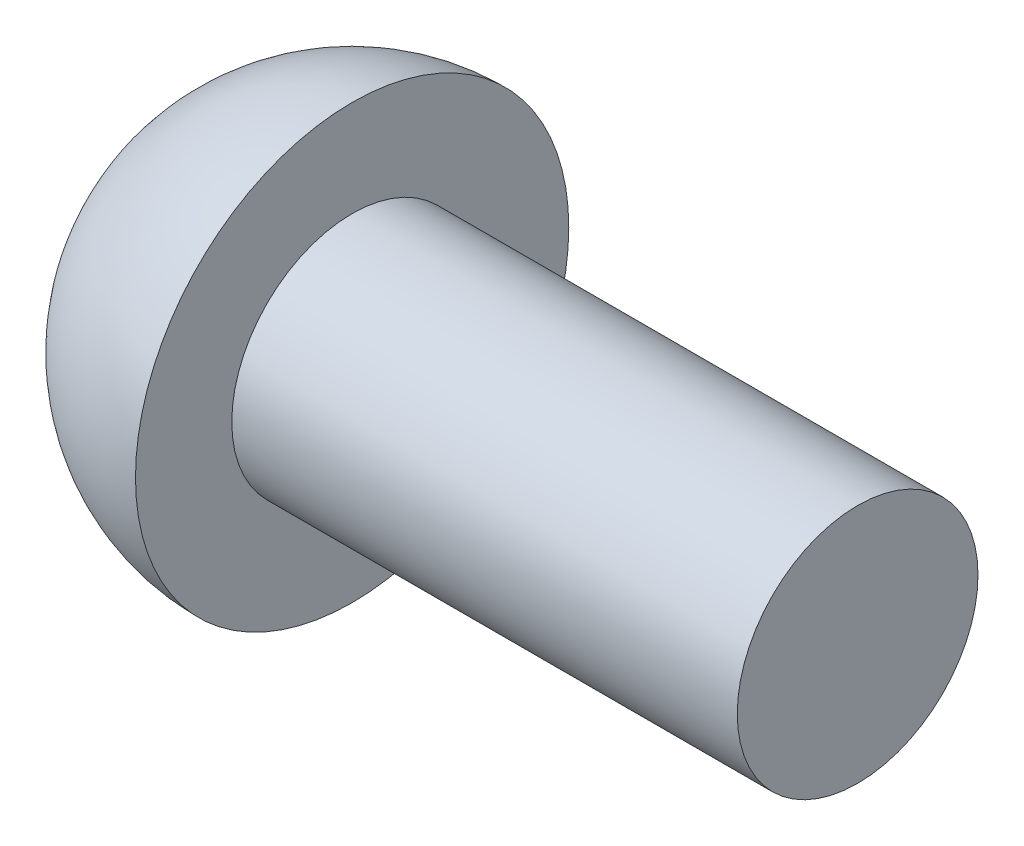
ISO-10303-21;
HEADER;
FILE_DESCRIPTION(('STEP AP214'),'2;1');
FILE_NAME('part.step','',(''),(''),'','','');
FILE_SCHEMA(('AUTOMOTIVE_DESIGN { 1 0 10303 214 1 1 1 1 }'));
ENDSEC;
DATA;
#1=APPLICATION_CONTEXT('core data for automotive mechanical design processes');
#2=APPLICATION_PROTOCOL_DEFINITION('international standard','automotive_design',2000,#1);
#3=PRODUCT_CONTEXT('',#1,'mechanical');
#4=PRODUCT('Part','Part','',(#3));
#5=PRODUCT_RELATED_PRODUCT_CATEGORY('part','',(#4));
#6=PRODUCT_DEFINITION_FORMATION('','',#4);
#7=PRODUCT_DEFINITION_CONTEXT('part definition',#1,'design');
#8=PRODUCT_DEFINITION('design','',#6,#7);
#9=PRODUCT_DEFINITION_SHAPE('','',#8);
#10=(LENGTH_UNIT() NAMED_UNIT(*) SI_UNIT(.MILLI.,.METRE.));
#11=(NAMED_UNIT(*) PLANE_ANGLE_UNIT() SI_UNIT($,.RADIAN.));
#12=(NAMED_UNIT(*) SI_UNIT($,.STERADIAN.) SOLID_ANGLE_UNIT());
#13=UNCERTAINTY_MEASURE_WITH_UNIT(LENGTH_MEASURE(1.E-05),#10,'distance_accuracy_value','');
#14=(GEOMETRIC_REPRESENTATION_CONTEXT(3) GLOBAL_UNCERTAINTY_ASSIGNED_CONTEXT((#13)) GLOBAL_UNIT_ASSIGNED_CONTEXT((#10,
#11,#12)) REPRESENTATION_CONTEXT('',''));
#15=CARTESIAN_POINT('',(0.,0.,0.));
#16=DIRECTION('',(0.,0.,1.));
#17=DIRECTION('',(1.,0.,0.));
#18=AXIS2_PLACEMENT_3D('',#15,#16,#17);
#19=CARTESIAN_POINT('',(0.,0.,0.));
#20=DIRECTION('',(-1.,0.,0.));
#21=DIRECTION('',(0.,0.,-1.));
#22=AXIS2_PLACEMENT_3D('',#19,#20,#21);
#23=SPHERICAL_SURFACE('',#22,9.);
#24=CARTESIAN_POINT('',(0.,0.,0.));
#25=DIRECTION('',(-1.,0.,0.));
#26=DIRECTION('',(0.,0.,1.));
#27=AXIS2_PLACEMENT_3D('',#24,#25,#26);
#28=CIRCLE('',#27,9.);
#29=CARTESIAN_POINT('',(0.,0.,9.));
#30=VERTEX_POINT('',#29);
#31=EDGE_CURVE('E42',#30,#30,#28,.T.);
#32=ORIENTED_EDGE('',*,*,#31,.T.);
#33=EDGE_LOOP('',(#32));
#34=FACE_BOUND('',#33,.T.);
#35=ADVANCED_FACE('F32',(#34),#23,.T.);
#36=CARTESIAN_POINT('',(21.,0.,0.));
#37=DIRECTION('',(-1.,0.,0.));
#38=DIRECTION('',(0.,0.,1.));
#39=AXIS2_PLACEMENT_3D('',#36,#37,#38);
#40=PLANE('',#39);
#41=CARTESIAN_POINT('',(21.,0.,0.));
#42=DIRECTION('',(-1.,0.,0.));
#43=DIRECTION('',(0.,0.,1.));
#44=AXIS2_PLACEMENT_3D('',#41,#42,#43);
#45=CIRCLE('',#44,5.);
#46=CARTESIAN_POINT('',(21.,0.,5.));
#47=VERTEX_POINT('',#46);
#48=EDGE_CURVE('E10',#47,#47,#45,.T.);
#49=ORIENTED_EDGE('',*,*,#48,.F.);
#50=EDGE_LOOP('',(#49));
#51=FACE_BOUND('',#50,.T.);
#52=ADVANCED_FACE('F57',(#51),#40,.F.);
#53=CARTESIAN_POINT('',(0.,0.,0.));
#54=DIRECTION('',(-1.,0.,0.));
#55=DIRECTION('',(0.,0.,1.));
#56=AXIS2_PLACEMENT_3D('',#53,#54,#55);
#57=CYLINDRICAL_SURFACE('',#56,5.);
#58=CARTESIAN_POINT('',(0.,0.,0.));
#59=DIRECTION('',(-1.,0.,0.));
#60=DIRECTION('',(0.,0.,1.));
#61=AXIS2_PLACEMENT_3D('',#58,#59,#60);
#62=CIRCLE('',#61,5.);
#63=CARTESIAN_POINT('',(0.,0.,5.));
#64=VERTEX_POINT('',#63);
#65=EDGE_CURVE('E38',#64,#64,#62,.T.);
#66=ORIENTED_EDGE('',*,*,#65,.F.);
#67=EDGE_LOOP('',(#66));
#68=FACE_BOUND('',#67,.T.);
#69=ORIENTED_EDGE('',*,*,#48,.T.);
#70=EDGE_LOOP('',(#69));
#71=FACE_BOUND('',#70,.T.);
#72=ADVANCED_FACE('F52',(#68,#71),#57,.T.);
#73=CARTESIAN_POINT('',(0.,0.,-5.));
#74=DIRECTION('',(-1.,0.,0.));
#75=DIRECTION('',(0.,0.,1.));
#76=AXIS2_PLACEMENT_3D('',#73,#74,#75);
#77=PLANE('',#76);
#78=ORIENTED_EDGE('',*,*,#31,.F.);
#79=EDGE_LOOP('',(#78));
#80=FACE_BOUND('',#79,.T.);
#81=ORIENTED_EDGE('',*,*,#65,.T.);
#82=EDGE_LOOP('',(#81));
#83=FACE_BOUND('',#82,.T.);
#84=ADVANCED_FACE('F50',(#80,#83),#77,.F.);
#85=CLOSED_SHELL('',(#35,#52,#72,#84));
#86=MANIFOLD_SOLID_BREP('B2',#85);
#87=ADVANCED_BREP_SHAPE_REPRESENTATION('',(#18,#86),#14);
#88=SHAPE_DEFINITION_REPRESENTATION(#9,#87);
ENDSEC;
END-ISO-10303-21;
